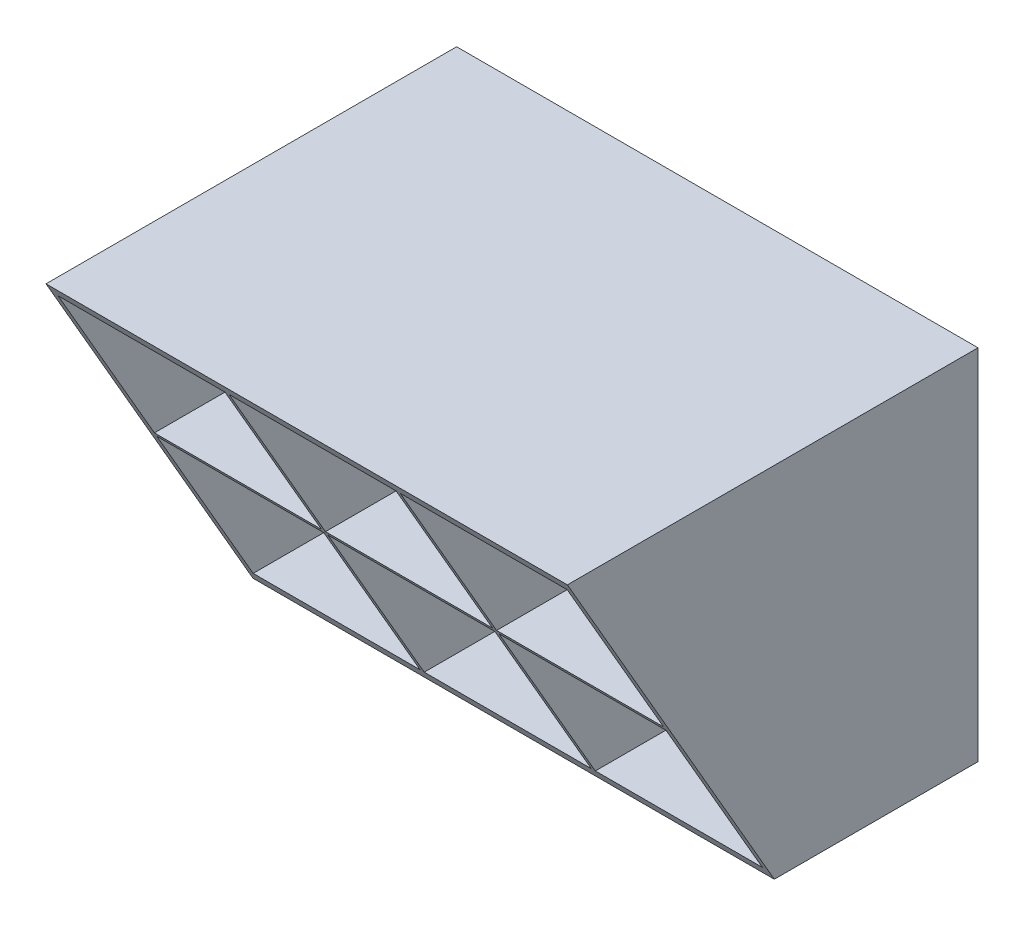
ISO-10303-21;
HEADER;
FILE_DESCRIPTION(('STEP AP214'),'2;1');
FILE_NAME('part.step','',(''),(''),'','','');
FILE_SCHEMA(('AUTOMOTIVE_DESIGN { 1 0 10303 214 1 1 1 1 }'));
ENDSEC;
DATA;
#1=APPLICATION_CONTEXT('core data for automotive mechanical design processes');
#2=APPLICATION_PROTOCOL_DEFINITION('international standard','automotive_design',2000,#1);
#3=PRODUCT_CONTEXT('',#1,'mechanical');
#4=PRODUCT('Part','Part','',(#3));
#5=PRODUCT_RELATED_PRODUCT_CATEGORY('part','',(#4));
#6=PRODUCT_DEFINITION_FORMATION('','',#4);
#7=PRODUCT_DEFINITION_CONTEXT('part definition',#1,'design');
#8=PRODUCT_DEFINITION('design','',#6,#7);
#9=PRODUCT_DEFINITION_SHAPE('','',#8);
#10=(LENGTH_UNIT() NAMED_UNIT(*) SI_UNIT(.MILLI.,.METRE.));
#11=(NAMED_UNIT(*) PLANE_ANGLE_UNIT() SI_UNIT($,.RADIAN.));
#12=(NAMED_UNIT(*) SI_UNIT($,.STERADIAN.) SOLID_ANGLE_UNIT());
#13=UNCERTAINTY_MEASURE_WITH_UNIT(LENGTH_MEASURE(1.E-05),#10,'distance_accuracy_value','');
#14=(GEOMETRIC_REPRESENTATION_CONTEXT(3) GLOBAL_UNCERTAINTY_ASSIGNED_CONTEXT((#13)) GLOBAL_UNIT_ASSIGNED_CONTEXT((#10,
#11,#12)) REPRESENTATION_CONTEXT('',''));
#15=CARTESIAN_POINT('',(0.,0.,0.));
#16=DIRECTION('',(0.,0.,1.));
#17=DIRECTION('',(1.,0.,0.));
#18=AXIS2_PLACEMENT_3D('',#15,#16,#17);
#19=CARTESIAN_POINT('',(-44.3982004158116,-9.53089722298802,25.0000000000002));
#20=DIRECTION('',(0.,-0.500000000000001,0.866025403784438));
#21=DIRECTION('',(0.,-0.866025403784438,-0.500000000000001));
#22=AXIS2_PLACEMENT_3D('',#19,#20,#21);
#23=PLANE('',#22);
#24=DIRECTION('',(0.,-0.866025403784438,-0.500000000000001));
#25=VECTOR('',#24,1.);
#26=CARTESIAN_POINT('',(-1.6482004158117,22.5316027770119,43.5112930058926));
#27=LINE('',#26,#25);
#28=CARTESIAN_POINT('',(-1.6482004158117,33.219102777012,49.6817240078568));
#29=VERTEX_POINT('',#28);
#30=CARTESIAN_POINT('',(-1.6482004158117,12.719102777012,37.8460434894694));
#31=VERTEX_POINT('',#30);
#32=EDGE_CURVE('E338',#29,#31,#27,.T.);
#33=ORIENTED_EDGE('',*,*,#32,.F.);
#34=DIRECTION('',(-1.,0.,0.));
#35=VECTOR('',#34,1.);
#36=CARTESIAN_POINT('',(-1.64820041581169,33.219102777012,49.6817240078568));
#37=LINE('',#36,#35);
#38=CARTESIAN_POINT('',(18.8517995841883,33.219102777012,49.6817240078568));
#39=VERTEX_POINT('',#38);
#40=EDGE_CURVE('E198',#39,#29,#37,.T.);
#41=ORIENTED_EDGE('',*,*,#40,.F.);
#42=DIRECTION('',(0.,0.866025403784438,0.500000000000001));
#43=VECTOR('',#42,1.);
#44=CARTESIAN_POINT('',(18.8517995841883,22.5316027770119,43.5112930058926));
#45=LINE('',#44,#43);
#46=CARTESIAN_POINT('',(18.8517995841883,12.719102777012,37.8460434894694));
#47=VERTEX_POINT('',#46);
#48=EDGE_CURVE('E203',#47,#39,#45,.T.);
#49=ORIENTED_EDGE('',*,*,#48,.F.);
#50=DIRECTION('',(1.,0.,0.));
#51=VECTOR('',#50,1.);
#52=CARTESIAN_POINT('',(-1.6482004158117,12.719102777012,37.8460434894694));
#53=LINE('',#52,#51);
#54=EDGE_CURVE('E340',#31,#47,#53,.T.);
#55=ORIENTED_EDGE('',*,*,#54,.F.);
#56=EDGE_LOOP('',(#33,#41,#49,#55));
#57=FACE_BOUND('',#56,.T.);
#58=DIRECTION('',(0.,-0.866025403784438,-0.500000000000001));
#59=VECTOR('',#58,1.);
#60=CARTESIAN_POINT('',(-22.6482004158117,22.5316027770119,43.5112930058926));
#61=LINE('',#60,#59);
#62=CARTESIAN_POINT('',(-22.6482004158117,33.219102777012,49.6817240078568));
#63=VERTEX_POINT('',#62);
#64=CARTESIAN_POINT('',(-22.6482004158117,12.719102777012,37.8460434894694));
#65=VERTEX_POINT('',#64);
#66=EDGE_CURVE('E345',#63,#65,#61,.T.);
#67=ORIENTED_EDGE('',*,*,#66,.F.);
#68=DIRECTION('',(-1.,0.,0.));
#69=VECTOR('',#68,1.);
#70=CARTESIAN_POINT('',(-22.6482004158117,33.219102777012,49.6817240078568));
#71=LINE('',#70,#69);
#72=CARTESIAN_POINT('',(-2.1482004158117,33.219102777012,49.6817240078568));
#73=VERTEX_POINT('',#72);
#74=EDGE_CURVE('E224',#73,#63,#71,.T.);
#75=ORIENTED_EDGE('',*,*,#74,.F.);
#76=DIRECTION('',(0.,0.866025403784438,0.500000000000001));
#77=VECTOR('',#76,1.);
#78=CARTESIAN_POINT('',(-2.1482004158117,22.5316027770119,43.5112930058926));
#79=LINE('',#78,#77);
#80=CARTESIAN_POINT('',(-2.1482004158117,12.719102777012,37.8460434894694));
#81=VERTEX_POINT('',#80);
#82=EDGE_CURVE('E229',#81,#73,#79,.T.);
#83=ORIENTED_EDGE('',*,*,#82,.F.);
#84=DIRECTION('',(1.,0.,0.));
#85=VECTOR('',#84,1.);
#86=CARTESIAN_POINT('',(-22.6482004158117,12.719102777012,37.8460434894694));
#87=LINE('',#86,#85);
#88=EDGE_CURVE('E347',#65,#81,#87,.T.);
#89=ORIENTED_EDGE('',*,*,#88,.F.);
#90=EDGE_LOOP('',(#67,#75,#83,#89));
#91=FACE_BOUND('',#90,.T.);
#92=DIRECTION('',(0.,-0.866025403784438,-0.500000000000001));
#93=VECTOR('',#92,1.);
#94=CARTESIAN_POINT('',(-1.64820041581162,6.78160277701196,34.418026266156));
#95=LINE('',#94,#93);
#96=CARTESIAN_POINT('',(-1.64820041581162,12.219102777012,37.5573683548746));
#97=VERTEX_POINT('',#96);
#98=CARTESIAN_POINT('',(-1.64820041581162,-8.28089722298802,25.7216878364872));
#99=VERTEX_POINT('',#98);
#100=EDGE_CURVE('E352',#97,#99,#95,.T.);
#101=ORIENTED_EDGE('',*,*,#100,.F.);
#102=DIRECTION('',(-1.,0.,0.));
#103=VECTOR('',#102,1.);
#104=CARTESIAN_POINT('',(-1.64820041581162,12.219102777012,37.5573683548746));
#105=LINE('',#104,#103);
#106=CARTESIAN_POINT('',(18.8517995841884,12.219102777012,37.5573683548746));
#107=VERTEX_POINT('',#106);
#108=EDGE_CURVE('E250',#107,#97,#105,.T.);
#109=ORIENTED_EDGE('',*,*,#108,.F.);
#110=DIRECTION('',(0.,0.866025403784438,0.500000000000001));
#111=VECTOR('',#110,1.);
#112=CARTESIAN_POINT('',(18.8517995841884,6.78160277701195,34.418026266156));
#113=LINE('',#112,#111);
#114=CARTESIAN_POINT('',(18.8517995841884,-8.28089722298802,25.7216878364872));
#115=VERTEX_POINT('',#114);
#116=EDGE_CURVE('E255',#115,#107,#113,.T.);
#117=ORIENTED_EDGE('',*,*,#116,.F.);
#118=DIRECTION('',(1.,0.,0.));
#119=VECTOR('',#118,1.);
#120=CARTESIAN_POINT('',(-1.64820041581162,-8.28089722298802,25.7216878364872));
#121=LINE('',#120,#119);
#122=EDGE_CURVE('E354',#99,#115,#121,.T.);
#123=ORIENTED_EDGE('',*,*,#122,.F.);
#124=EDGE_LOOP('',(#101,#109,#117,#123));
#125=FACE_BOUND('',#124,.T.);
#126=DIRECTION('',(0.,-0.866025403784438,-0.500000000000001));
#127=VECTOR('',#126,1.);
#128=CARTESIAN_POINT('',(-22.6482004158116,6.78160277701196,34.418026266156));
#129=LINE('',#128,#127);
#130=CARTESIAN_POINT('',(-22.6482004158116,12.219102777012,37.5573683548746));
#131=VERTEX_POINT('',#130);
#132=CARTESIAN_POINT('',(-22.6482004158116,-8.28089722298802,25.7216878364872));
#133=VERTEX_POINT('',#132);
#134=EDGE_CURVE('E359',#131,#133,#129,.T.);
#135=ORIENTED_EDGE('',*,*,#134,.F.);
#136=DIRECTION('',(-1.,0.,0.));
#137=VECTOR('',#136,1.);
#138=CARTESIAN_POINT('',(-22.6482004158116,12.219102777012,37.5573683548746));
#139=LINE('',#138,#137);
#140=CARTESIAN_POINT('',(-2.14820041581162,12.219102777012,37.5573683548746));
#141=VERTEX_POINT('',#140);
#142=EDGE_CURVE('E276',#141,#131,#139,.T.);
#143=ORIENTED_EDGE('',*,*,#142,.F.);
#144=DIRECTION('',(0.,0.866025403784438,0.500000000000001));
#145=VECTOR('',#144,1.);
#146=CARTESIAN_POINT('',(-2.14820041581162,6.78160277701195,34.418026266156));
#147=LINE('',#146,#145);
#148=CARTESIAN_POINT('',(-2.14820041581162,-8.28089722298802,25.7216878364872));
#149=VERTEX_POINT('',#148);
#150=EDGE_CURVE('E281',#149,#141,#147,.T.);
#151=ORIENTED_EDGE('',*,*,#150,.F.);
#152=DIRECTION('',(1.,0.,0.));
#153=VECTOR('',#152,1.);
#154=CARTESIAN_POINT('',(-22.6482004158116,-8.28089722298802,25.7216878364872));
#155=LINE('',#154,#153);
#156=EDGE_CURVE('E361',#133,#149,#155,.T.);
#157=ORIENTED_EDGE('',*,*,#156,.F.);
#158=EDGE_LOOP('',(#135,#143,#151,#157));
#159=FACE_BOUND('',#158,.T.);
#160=DIRECTION('',(0.,-0.866025403784438,-0.500000000000001));
#161=VECTOR('',#160,1.);
#162=CARTESIAN_POINT('',(-43.6482004158117,22.5316027770119,43.5112930058926));
#163=LINE('',#162,#161);
#164=CARTESIAN_POINT('',(-43.6482004158117,33.219102777012,49.6817240078568));
#165=VERTEX_POINT('',#164);
#166=CARTESIAN_POINT('',(-43.6482004158117,12.719102777012,37.8460434894694));
#167=VERTEX_POINT('',#166);
#168=EDGE_CURVE('E366',#165,#167,#163,.T.);
#169=ORIENTED_EDGE('',*,*,#168,.F.);
#170=DIRECTION('',(-1.,0.,0.));
#171=VECTOR('',#170,1.);
#172=CARTESIAN_POINT('',(-43.6482004158117,33.219102777012,49.6817240078568));
#173=LINE('',#172,#171);
#174=CARTESIAN_POINT('',(-23.1482004158117,33.219102777012,49.6817240078568));
#175=VERTEX_POINT('',#174);
#176=EDGE_CURVE('E302',#175,#165,#173,.T.);
#177=ORIENTED_EDGE('',*,*,#176,.F.);
#178=DIRECTION('',(0.,0.866025403784438,0.500000000000001));
#179=VECTOR('',#178,1.);
#180=CARTESIAN_POINT('',(-23.1482004158117,22.5316027770119,43.5112930058926));
#181=LINE('',#180,#179);
#182=CARTESIAN_POINT('',(-23.1482004158117,12.719102777012,37.8460434894694));
#183=VERTEX_POINT('',#182);
#184=EDGE_CURVE('E307',#183,#175,#181,.T.);
#185=ORIENTED_EDGE('',*,*,#184,.F.);
#186=DIRECTION('',(1.,0.,0.));
#187=VECTOR('',#186,1.);
#188=CARTESIAN_POINT('',(-43.6482004158117,12.719102777012,37.8460434894694));
#189=LINE('',#188,#187);
#190=EDGE_CURVE('E368',#167,#183,#189,.T.);
#191=ORIENTED_EDGE('',*,*,#190,.F.);
#192=EDGE_LOOP('',(#169,#177,#185,#191));
#193=FACE_BOUND('',#192,.T.);
#194=DIRECTION('',(1.,0.,0.));
#195=VECTOR('',#194,1.);
#196=CARTESIAN_POINT('',(-43.6482004158116,-8.28089722298802,25.7216878364872));
#197=LINE('',#196,#195);
#198=CARTESIAN_POINT('',(-43.6482004158116,-8.28089722298802,25.7216878364872));
#199=VERTEX_POINT('',#198);
#200=CARTESIAN_POINT('',(-23.1482004158116,-8.28089722298802,25.7216878364872));
#201=VERTEX_POINT('',#200);
#202=EDGE_CURVE('E373',#199,#201,#197,.T.);
#203=ORIENTED_EDGE('',*,*,#202,.F.);
#204=DIRECTION('',(0.,-0.866025403784438,-0.500000000000001));
#205=VECTOR('',#204,1.);
#206=CARTESIAN_POINT('',(-43.6482004158116,6.78160277701196,34.418026266156));
#207=LINE('',#206,#205);
#208=CARTESIAN_POINT('',(-43.6482004158116,12.219102777012,37.5573683548746));
#209=VERTEX_POINT('',#208);
#210=EDGE_CURVE('E328',#209,#199,#207,.T.);
#211=ORIENTED_EDGE('',*,*,#210,.F.);
#212=DIRECTION('',(-1.,0.,0.));
#213=VECTOR('',#212,1.);
#214=CARTESIAN_POINT('',(-43.6482004158116,12.219102777012,37.5573683548746));
#215=LINE('',#214,#213);
#216=CARTESIAN_POINT('',(-23.1482004158116,12.219102777012,37.5573683548746));
#217=VERTEX_POINT('',#216);
#218=EDGE_CURVE('E333',#217,#209,#215,.T.);
#219=ORIENTED_EDGE('',*,*,#218,.F.);
#220=DIRECTION('',(0.,0.866025403784438,0.500000000000001));
#221=VECTOR('',#220,1.);
#222=CARTESIAN_POINT('',(-23.1482004158116,6.78160277701195,34.418026266156));
#223=LINE('',#222,#221);
#224=EDGE_CURVE('E375',#201,#217,#223,.T.);
#225=ORIENTED_EDGE('',*,*,#224,.F.);
#226=EDGE_LOOP('',(#203,#211,#219,#225));
#227=FACE_BOUND('',#226,.T.);
#228=DIRECTION('',(1.,0.,0.));
#229=VECTOR('',#228,1.);
#230=CARTESIAN_POINT('',(-44.3982004158116,-9.53089722298802,25.0000000000002));
#231=LINE('',#230,#229);
#232=CARTESIAN_POINT('',(-44.3982004158116,-9.53089722298802,25.0000000000002));
#233=VERTEX_POINT('',#232);
#234=CARTESIAN_POINT('',(19.6017995841884,-9.53089722298802,25.0000000000002));
#235=VERTEX_POINT('',#234);
#236=EDGE_CURVE('E175',#233,#235,#231,.T.);
#237=ORIENTED_EDGE('',*,*,#236,.T.);
#238=DIRECTION('',(0.,0.866025403784438,0.500000000000001));
#239=VECTOR('',#238,1.);
#240=CARTESIAN_POINT('',(19.6017995841884,-9.53089722298803,25.0000000000002));
#241=LINE('',#240,#239);
#242=CARTESIAN_POINT('',(19.6017995841884,34.469102777012,50.4034118443438));
#243=VERTEX_POINT('',#242);
#244=EDGE_CURVE('E36',#235,#243,#241,.T.);
#245=ORIENTED_EDGE('',*,*,#244,.T.);
#246=DIRECTION('',(-1.,0.,0.));
#247=VECTOR('',#246,1.);
#248=CARTESIAN_POINT('',(-44.3982004158116,34.469102777012,50.4034118443438));
#249=LINE('',#248,#247);
#250=CARTESIAN_POINT('',(-44.3982004158116,34.469102777012,50.4034118443438));
#251=VERTEX_POINT('',#250);
#252=EDGE_CURVE('E169',#243,#251,#249,.T.);
#253=ORIENTED_EDGE('',*,*,#252,.T.);
#254=DIRECTION('',(0.,-0.866025403784438,-0.500000000000001));
#255=VECTOR('',#254,1.);
#256=CARTESIAN_POINT('',(-44.3982004158116,-9.53089722298802,25.0000000000002));
#257=LINE('',#256,#255);
#258=EDGE_CURVE('E151',#251,#233,#257,.T.);
#259=ORIENTED_EDGE('',*,*,#258,.T.);
#260=EDGE_LOOP('',(#237,#245,#253,#259));
#261=FACE_BOUND('',#260,.T.);
#262=ADVANCED_FACE('F33',(#57,#91,#125,#159,#193,#227,#261),#23,.T.);
#263=CARTESIAN_POINT('',(36.9866380266075,-28.7048863636364,2.00445150144498E-13));
#264=DIRECTION('',(0.,0.,1.));
#265=DIRECTION('',(1.,0.,0.));
#266=AXIS2_PLACEMENT_3D('',#263,#264,#265);
#267=PLANE('',#266);
#268=DIRECTION('',(-1.,0.,0.));
#269=VECTOR('',#268,1.);
#270=CARTESIAN_POINT('',(-1.6482004158117,33.219102777012,2.00445150144498E-13));
#271=LINE('',#270,#269);
#272=CARTESIAN_POINT('',(18.8517995841883,33.219102777012,2.00445150144498E-13));
#273=VERTEX_POINT('',#272);
#274=CARTESIAN_POINT('',(-1.6482004158117,33.219102777012,2.00445150144498E-13));
#275=VERTEX_POINT('',#274);
#276=EDGE_CURVE('E182',#273,#275,#271,.T.);
#277=ORIENTED_EDGE('',*,*,#276,.T.);
#278=DIRECTION('',(0.,-1.,0.));
#279=VECTOR('',#278,1.);
#280=CARTESIAN_POINT('',(-1.6482004158117,33.219102777012,2.00445150144498E-13));
#281=LINE('',#280,#279);
#282=CARTESIAN_POINT('',(-1.6482004158117,12.719102777012,2.00445150144498E-13));
#283=VERTEX_POINT('',#282);
#284=EDGE_CURVE('E189',#275,#283,#281,.T.);
#285=ORIENTED_EDGE('',*,*,#284,.T.);
#286=DIRECTION('',(1.,0.,0.));
#287=VECTOR('',#286,1.);
#288=CARTESIAN_POINT('',(-1.6482004158117,12.719102777012,2.00445150144498E-13));
#289=LINE('',#288,#287);
#290=CARTESIAN_POINT('',(18.8517995841883,12.719102777012,2.00445150144498E-13));
#291=VERTEX_POINT('',#290);
#292=EDGE_CURVE('E192',#283,#291,#289,.T.);
#293=ORIENTED_EDGE('',*,*,#292,.T.);
#294=DIRECTION('',(0.,1.,0.));
#295=VECTOR('',#294,1.);
#296=CARTESIAN_POINT('',(18.8517995841883,33.219102777012,2.00445150144498E-13));
#297=LINE('',#296,#295);
#298=EDGE_CURVE('E195',#291,#273,#297,.T.);
#299=ORIENTED_EDGE('',*,*,#298,.T.);
#300=EDGE_LOOP('',(#277,#285,#293,#299));
#301=FACE_BOUND('',#300,.T.);
#302=DIRECTION('',(-1.,0.,0.));
#303=VECTOR('',#302,1.);
#304=CARTESIAN_POINT('',(-1.64820041581162,12.219102777012,2.00445150144498E-13));
#305=LINE('',#304,#303);
#306=CARTESIAN_POINT('',(18.8517995841884,12.219102777012,2.00445150144498E-13));
#307=VERTEX_POINT('',#306);
#308=CARTESIAN_POINT('',(-1.64820041581162,12.219102777012,2.00445150144498E-13));
#309=VERTEX_POINT('',#308);
#310=EDGE_CURVE('E238',#307,#309,#305,.T.);
#311=ORIENTED_EDGE('',*,*,#310,.T.);
#312=DIRECTION('',(0.,-1.,0.));
#313=VECTOR('',#312,1.);
#314=CARTESIAN_POINT('',(-1.64820041581162,12.219102777012,2.00445150144498E-13));
#315=LINE('',#314,#313);
#316=CARTESIAN_POINT('',(-1.64820041581162,-8.28089722298802,2.00445150144498E-13));
#317=VERTEX_POINT('',#316);
#318=EDGE_CURVE('E241',#309,#317,#315,.T.);
#319=ORIENTED_EDGE('',*,*,#318,.T.);
#320=DIRECTION('',(1.,0.,0.));
#321=VECTOR('',#320,1.);
#322=CARTESIAN_POINT('',(-1.64820041581162,-8.28089722298802,2.00445150144498E-13));
#323=LINE('',#322,#321);
#324=CARTESIAN_POINT('',(18.8517995841884,-8.28089722298802,2.00445150144498E-13));
#325=VERTEX_POINT('',#324);
#326=EDGE_CURVE('E244',#317,#325,#323,.T.);
#327=ORIENTED_EDGE('',*,*,#326,.T.);
#328=DIRECTION('',(0.,1.,0.));
#329=VECTOR('',#328,1.);
#330=CARTESIAN_POINT('',(18.8517995841884,12.219102777012,2.00445150144498E-13));
#331=LINE('',#330,#329);
#332=EDGE_CURVE('E247',#325,#307,#331,.T.);
#333=ORIENTED_EDGE('',*,*,#332,.T.);
#334=EDGE_LOOP('',(#311,#319,#327,#333));
#335=FACE_BOUND('',#334,.T.);
#336=DIRECTION('',(-1.,0.,0.));
#337=VECTOR('',#336,1.);
#338=CARTESIAN_POINT('',(-43.6482004158117,33.219102777012,2.00445150144498E-13));
#339=LINE('',#338,#337);
#340=CARTESIAN_POINT('',(-23.1482004158117,33.219102777012,2.00445150144498E-13));
#341=VERTEX_POINT('',#340);
#342=CARTESIAN_POINT('',(-43.6482004158117,33.219102777012,2.00445150144498E-13));
#343=VERTEX_POINT('',#342);
#344=EDGE_CURVE('E290',#341,#343,#339,.T.);
#345=ORIENTED_EDGE('',*,*,#344,.T.);
#346=DIRECTION('',(0.,-1.,0.));
#347=VECTOR('',#346,1.);
#348=CARTESIAN_POINT('',(-43.6482004158117,33.219102777012,2.00445150144498E-13));
#349=LINE('',#348,#347);
#350=CARTESIAN_POINT('',(-43.6482004158117,12.719102777012,2.00445150144498E-13));
#351=VERTEX_POINT('',#350);
#352=EDGE_CURVE('E293',#343,#351,#349,.T.);
#353=ORIENTED_EDGE('',*,*,#352,.T.);
#354=DIRECTION('',(1.,0.,0.));
#355=VECTOR('',#354,1.);
#356=CARTESIAN_POINT('',(-43.6482004158117,12.719102777012,2.00445150144498E-13));
#357=LINE('',#356,#355);
#358=CARTESIAN_POINT('',(-23.1482004158117,12.719102777012,2.00445150144498E-13));
#359=VERTEX_POINT('',#358);
#360=EDGE_CURVE('E296',#351,#359,#357,.T.);
#361=ORIENTED_EDGE('',*,*,#360,.T.);
#362=DIRECTION('',(0.,1.,0.));
#363=VECTOR('',#362,1.);
#364=CARTESIAN_POINT('',(-23.1482004158117,33.219102777012,2.00445150144498E-13));
#365=LINE('',#364,#363);
#366=EDGE_CURVE('E299',#359,#341,#365,.T.);
#367=ORIENTED_EDGE('',*,*,#366,.T.);
#368=EDGE_LOOP('',(#345,#353,#361,#367));
#369=FACE_BOUND('',#368,.T.);
#370=DIRECTION('',(0.,-1.,0.));
#371=VECTOR('',#370,1.);
#372=CARTESIAN_POINT('',(-43.6482004158116,12.219102777012,2.00445150144498E-13));
#373=LINE('',#372,#371);
#374=CARTESIAN_POINT('',(-43.6482004158116,12.219102777012,2.00445150144498E-13));
#375=VERTEX_POINT('',#374);
#376=CARTESIAN_POINT('',(-43.6482004158116,-8.28089722298802,2.00445150144498E-13));
#377=VERTEX_POINT('',#376);
#378=EDGE_CURVE('E316',#375,#377,#373,.T.);
#379=ORIENTED_EDGE('',*,*,#378,.T.);
#380=DIRECTION('',(1.,0.,0.));
#381=VECTOR('',#380,1.);
#382=CARTESIAN_POINT('',(-43.6482004158116,-8.28089722298802,2.00445150144498E-13));
#383=LINE('',#382,#381);
#384=CARTESIAN_POINT('',(-23.1482004158116,-8.28089722298802,2.00445150144498E-13));
#385=VERTEX_POINT('',#384);
#386=EDGE_CURVE('E319',#377,#385,#383,.T.);
#387=ORIENTED_EDGE('',*,*,#386,.T.);
#388=DIRECTION('',(0.,1.,0.));
#389=VECTOR('',#388,1.);
#390=CARTESIAN_POINT('',(-23.1482004158116,12.219102777012,2.00445150144498E-13));
#391=LINE('',#390,#389);
#392=CARTESIAN_POINT('',(-23.1482004158116,12.219102777012,2.00445150144498E-13));
#393=VERTEX_POINT('',#392);
#394=EDGE_CURVE('E322',#385,#393,#391,.T.);
#395=ORIENTED_EDGE('',*,*,#394,.T.);
#396=DIRECTION('',(-1.,0.,0.));
#397=VECTOR('',#396,1.);
#398=CARTESIAN_POINT('',(-43.6482004158116,12.219102777012,2.00445150144498E-13));
#399=LINE('',#398,#397);
#400=EDGE_CURVE('E325',#393,#375,#399,.T.);
#401=ORIENTED_EDGE('',*,*,#400,.T.);
#402=EDGE_LOOP('',(#379,#387,#395,#401));
#403=FACE_BOUND('',#402,.T.);
#404=DIRECTION('',(-1.,0.,0.));
#405=VECTOR('',#404,1.);
#406=CARTESIAN_POINT('',(-22.6482004158116,12.219102777012,2.00445150144498E-13));
#407=LINE('',#406,#405);
#408=CARTESIAN_POINT('',(-2.14820041581162,12.219102777012,2.00445150144498E-13));
#409=VERTEX_POINT('',#408);
#410=CARTESIAN_POINT('',(-22.6482004158116,12.219102777012,2.00445150144498E-13));
#411=VERTEX_POINT('',#410);
#412=EDGE_CURVE('E264',#409,#411,#407,.T.);
#413=ORIENTED_EDGE('',*,*,#412,.T.);
#414=DIRECTION('',(0.,-1.,0.));
#415=VECTOR('',#414,1.);
#416=CARTESIAN_POINT('',(-22.6482004158116,12.219102777012,2.00445150144498E-13));
#417=LINE('',#416,#415);
#418=CARTESIAN_POINT('',(-22.6482004158116,-8.28089722298802,2.00445150144498E-13));
#419=VERTEX_POINT('',#418);
#420=EDGE_CURVE('E267',#411,#419,#417,.T.);
#421=ORIENTED_EDGE('',*,*,#420,.T.);
#422=DIRECTION('',(1.,0.,0.));
#423=VECTOR('',#422,1.);
#424=CARTESIAN_POINT('',(-22.6482004158116,-8.28089722298802,2.00445150144498E-13));
#425=LINE('',#424,#423);
#426=CARTESIAN_POINT('',(-2.14820041581162,-8.28089722298802,2.00445150144498E-13));
#427=VERTEX_POINT('',#426);
#428=EDGE_CURVE('E270',#419,#427,#425,.T.);
#429=ORIENTED_EDGE('',*,*,#428,.T.);
#430=DIRECTION('',(0.,1.,0.));
#431=VECTOR('',#430,1.);
#432=CARTESIAN_POINT('',(-2.14820041581162,12.219102777012,2.00445150144498E-13));
#433=LINE('',#432,#431);
#434=EDGE_CURVE('E273',#427,#409,#433,.T.);
#435=ORIENTED_EDGE('',*,*,#434,.T.);
#436=EDGE_LOOP('',(#413,#421,#429,#435));
#437=FACE_BOUND('',#436,.T.);
#438=DIRECTION('',(-1.,0.,0.));
#439=VECTOR('',#438,1.);
#440=CARTESIAN_POINT('',(-22.6482004158117,33.219102777012,2.00445150144498E-13));
#441=LINE('',#440,#439);
#442=CARTESIAN_POINT('',(-2.1482004158117,33.219102777012,2.00445150144498E-13));
#443=VERTEX_POINT('',#442);
#444=CARTESIAN_POINT('',(-22.6482004158117,33.219102777012,2.00445150144498E-13));
#445=VERTEX_POINT('',#444);
#446=EDGE_CURVE('E212',#443,#445,#441,.T.);
#447=ORIENTED_EDGE('',*,*,#446,.T.);
#448=DIRECTION('',(0.,-1.,0.));
#449=VECTOR('',#448,1.);
#450=CARTESIAN_POINT('',(-22.6482004158117,33.219102777012,2.00445150144498E-13));
#451=LINE('',#450,#449);
#452=CARTESIAN_POINT('',(-22.6482004158117,12.719102777012,2.00445150144498E-13));
#453=VERTEX_POINT('',#452);
#454=EDGE_CURVE('E215',#445,#453,#451,.T.);
#455=ORIENTED_EDGE('',*,*,#454,.T.);
#456=DIRECTION('',(1.,0.,0.));
#457=VECTOR('',#456,1.);
#458=CARTESIAN_POINT('',(-22.6482004158117,12.719102777012,2.00445150144498E-13));
#459=LINE('',#458,#457);
#460=CARTESIAN_POINT('',(-2.1482004158117,12.719102777012,2.00445150144498E-13));
#461=VERTEX_POINT('',#460);
#462=EDGE_CURVE('E218',#453,#461,#459,.T.);
#463=ORIENTED_EDGE('',*,*,#462,.T.);
#464=DIRECTION('',(0.,1.,0.));
#465=VECTOR('',#464,1.);
#466=CARTESIAN_POINT('',(-2.1482004158117,33.219102777012,2.00445150144498E-13));
#467=LINE('',#466,#465);
#468=EDGE_CURVE('E221',#461,#443,#467,.T.);
#469=ORIENTED_EDGE('',*,*,#468,.T.);
#470=EDGE_LOOP('',(#447,#455,#463,#469));
#471=FACE_BOUND('',#470,.T.);
#472=DIRECTION('',(-1.,0.,0.));
#473=VECTOR('',#472,1.);
#474=CARTESIAN_POINT('',(-44.3982004158116,34.469102777012,2.0122792321331E-13));
#475=LINE('',#474,#473);
#476=CARTESIAN_POINT('',(19.6017995841884,34.469102777012,2.0122792321331E-13));
#477=VERTEX_POINT('',#476);
#478=CARTESIAN_POINT('',(-44.3982004158116,34.469102777012,2.0122792321331E-13));
#479=VERTEX_POINT('',#478);
#480=EDGE_CURVE('E180',#477,#479,#475,.T.);
#481=ORIENTED_EDGE('',*,*,#480,.F.);
#482=DIRECTION('',(0.,1.,0.));
#483=VECTOR('',#482,1.);
#484=CARTESIAN_POINT('',(19.6017995841884,34.469102777012,2.0122792321331E-13));
#485=LINE('',#484,#483);
#486=CARTESIAN_POINT('',(19.6017995841884,-9.53089722298802,2.0122792321331E-13));
#487=VERTEX_POINT('',#486);
#488=EDGE_CURVE('E161',#487,#477,#485,.T.);
#489=ORIENTED_EDGE('',*,*,#488,.F.);
#490=DIRECTION('',(1.,0.,0.));
#491=VECTOR('',#490,1.);
#492=CARTESIAN_POINT('',(-44.3982004158116,-9.53089722298802,2.0122792321331E-13));
#493=LINE('',#492,#491);
#494=CARTESIAN_POINT('',(-44.3982004158116,-9.53089722298802,2.00445150144498E-13));
#495=VERTEX_POINT('',#494);
#496=EDGE_CURVE('E755',#495,#487,#493,.T.);
#497=ORIENTED_EDGE('',*,*,#496,.F.);
#498=DIRECTION('',(0.,-1.,0.));
#499=VECTOR('',#498,1.);
#500=CARTESIAN_POINT('',(-44.3982004158116,34.469102777012,2.0122792321331E-13));
#501=LINE('',#500,#499);
#502=EDGE_CURVE('E172',#479,#495,#501,.T.);
#503=ORIENTED_EDGE('',*,*,#502,.F.);
#504=EDGE_LOOP('',(#481,#489,#497,#503));
#505=FACE_BOUND('',#504,.T.);
#506=ADVANCED_FACE('F423',(#301,#335,#369,#403,#437,#471,#505),#267,.F.);
#507=CARTESIAN_POINT('',(-43.6482004158116,12.219102777012,25.0000000000002));
#508=DIRECTION('',(1.,0.,0.));
#509=DIRECTION('',(0.,0.,-1.));
#510=AXIS2_PLACEMENT_3D('',#507,#508,#509);
#511=PLANE('',#510);
#512=ORIENTED_EDGE('',*,*,#378,.F.);
#513=DIRECTION('',(0.,0.,-1.));
#514=VECTOR('',#513,1.);
#515=CARTESIAN_POINT('',(-43.6482004158116,12.219102777012,25.0000000000002));
#516=LINE('',#515,#514);
#517=EDGE_CURVE('E329',#209,#375,#516,.T.);
#518=ORIENTED_EDGE('',*,*,#517,.F.);
#519=ORIENTED_EDGE('',*,*,#210,.T.);
#520=DIRECTION('',(0.,0.,-1.));
#521=VECTOR('',#520,1.);
#522=CARTESIAN_POINT('',(-43.6482004158116,-8.28089722298802,25.0000000000002));
#523=LINE('',#522,#521);
#524=EDGE_CURVE('E11',#199,#377,#523,.T.);
#525=ORIENTED_EDGE('',*,*,#524,.T.);
#526=EDGE_LOOP('',(#512,#518,#519,#525));
#527=FACE_BOUND('',#526,.T.);
#528=ADVANCED_FACE('F384',(#527),#511,.T.);
#529=CARTESIAN_POINT('',(-43.6482004158116,-8.28089722298802,25.0000000000002));
#530=DIRECTION('',(0.,1.,0.));
#531=DIRECTION('',(0.,0.,1.));
#532=AXIS2_PLACEMENT_3D('',#529,#530,#531);
#533=PLANE('',#532);
#534=ORIENTED_EDGE('',*,*,#386,.F.);
#535=ORIENTED_EDGE('',*,*,#524,.F.);
#536=ORIENTED_EDGE('',*,*,#202,.T.);
#537=DIRECTION('',(0.,0.,-1.));
#538=VECTOR('',#537,1.);
#539=CARTESIAN_POINT('',(-23.1482004158116,-8.28089722298802,25.0000000000002));
#540=LINE('',#539,#538);
#541=EDGE_CURVE('E42',#201,#385,#540,.T.);
#542=ORIENTED_EDGE('',*,*,#541,.T.);
#543=EDGE_LOOP('',(#534,#535,#536,#542));
#544=FACE_BOUND('',#543,.T.);
#545=ADVANCED_FACE('F390',(#544),#533,.T.);
#546=CARTESIAN_POINT('',(-23.1482004158116,12.219102777012,25.0000000000002));
#547=DIRECTION('',(-1.,0.,0.));
#548=DIRECTION('',(0.,0.,1.));
#549=AXIS2_PLACEMENT_3D('',#546,#547,#548);
#550=PLANE('',#549);
#551=ORIENTED_EDGE('',*,*,#394,.F.);
#552=ORIENTED_EDGE('',*,*,#541,.F.);
#553=ORIENTED_EDGE('',*,*,#224,.T.);
#554=DIRECTION('',(0.,0.,-1.));
#555=VECTOR('',#554,1.);
#556=CARTESIAN_POINT('',(-23.1482004158116,12.219102777012,25.0000000000002));
#557=LINE('',#556,#555);
#558=EDGE_CURVE('E332',#217,#393,#557,.T.);
#559=ORIENTED_EDGE('',*,*,#558,.T.);
#560=EDGE_LOOP('',(#551,#552,#553,#559));
#561=FACE_BOUND('',#560,.T.);
#562=ADVANCED_FACE('F395',(#561),#550,.T.);
#563=CARTESIAN_POINT('',(-43.6482004158116,12.219102777012,25.0000000000002));
#564=DIRECTION('',(0.,-1.,0.));
#565=DIRECTION('',(1.,0.,0.));
#566=AXIS2_PLACEMENT_3D('',#563,#564,#565);
#567=PLANE('',#566);
#568=ORIENTED_EDGE('',*,*,#400,.F.);
#569=ORIENTED_EDGE('',*,*,#558,.F.);
#570=ORIENTED_EDGE('',*,*,#218,.T.);
#571=ORIENTED_EDGE('',*,*,#517,.T.);
#572=EDGE_LOOP('',(#568,#569,#570,#571));
#573=FACE_BOUND('',#572,.T.);
#574=ADVANCED_FACE('F536',(#573),#567,.T.);
#575=CARTESIAN_POINT('',(-43.6482004158117,33.219102777012,25.0000000000002));
#576=DIRECTION('',(0.,-1.,0.));
#577=DIRECTION('',(1.,0.,0.));
#578=AXIS2_PLACEMENT_3D('',#575,#576,#577);
#579=PLANE('',#578);
#580=ORIENTED_EDGE('',*,*,#344,.F.);
#581=DIRECTION('',(0.,0.,-1.));
#582=VECTOR('',#581,1.);
#583=CARTESIAN_POINT('',(-23.1482004158117,33.219102777012,25.0000000000002));
#584=LINE('',#583,#582);
#585=EDGE_CURVE('E303',#175,#341,#584,.T.);
#586=ORIENTED_EDGE('',*,*,#585,.F.);
#587=ORIENTED_EDGE('',*,*,#176,.T.);
#588=DIRECTION('',(0.,0.,-1.));
#589=VECTOR('',#588,1.);
#590=CARTESIAN_POINT('',(-43.6482004158117,33.219102777012,25.0000000000002));
#591=LINE('',#590,#589);
#592=EDGE_CURVE('E313',#165,#343,#591,.T.);
#593=ORIENTED_EDGE('',*,*,#592,.T.);
#594=EDGE_LOOP('',(#580,#586,#587,#593));
#595=FACE_BOUND('',#594,.T.);
#596=ADVANCED_FACE('F474',(#595),#579,.T.);
#597=CARTESIAN_POINT('',(-43.6482004158117,33.219102777012,25.0000000000002));
#598=DIRECTION('',(1.,0.,0.));
#599=DIRECTION('',(0.,0.,-1.));
#600=AXIS2_PLACEMENT_3D('',#597,#598,#599);
#601=PLANE('',#600);
#602=ORIENTED_EDGE('',*,*,#352,.F.);
#603=ORIENTED_EDGE('',*,*,#592,.F.);
#604=ORIENTED_EDGE('',*,*,#168,.T.);
#605=DIRECTION('',(0.,0.,-1.));
#606=VECTOR('',#605,1.);
#607=CARTESIAN_POINT('',(-43.6482004158117,12.719102777012,25.0000000000002));
#608=LINE('',#607,#606);
#609=EDGE_CURVE('E310',#167,#351,#608,.T.);
#610=ORIENTED_EDGE('',*,*,#609,.T.);
#611=EDGE_LOOP('',(#602,#603,#604,#610));
#612=FACE_BOUND('',#611,.T.);
#613=ADVANCED_FACE('F471',(#612),#601,.T.);
#614=CARTESIAN_POINT('',(-43.6482004158117,12.719102777012,25.0000000000002));
#615=DIRECTION('',(0.,1.,0.));
#616=DIRECTION('',(0.,0.,1.));
#617=AXIS2_PLACEMENT_3D('',#614,#615,#616);
#618=PLANE('',#617);
#619=ORIENTED_EDGE('',*,*,#360,.F.);
#620=ORIENTED_EDGE('',*,*,#609,.F.);
#621=ORIENTED_EDGE('',*,*,#190,.T.);
#622=DIRECTION('',(0.,0.,-1.));
#623=VECTOR('',#622,1.);
#624=CARTESIAN_POINT('',(-23.1482004158117,12.719102777012,25.0000000000002));
#625=LINE('',#624,#623);
#626=EDGE_CURVE('E306',#183,#359,#625,.T.);
#627=ORIENTED_EDGE('',*,*,#626,.T.);
#628=EDGE_LOOP('',(#619,#620,#621,#627));
#629=FACE_BOUND('',#628,.T.);
#630=ADVANCED_FACE('F460',(#629),#618,.T.);
#631=CARTESIAN_POINT('',(-23.1482004158117,33.219102777012,25.0000000000002));
#632=DIRECTION('',(-1.,0.,0.));
#633=DIRECTION('',(0.,0.,1.));
#634=AXIS2_PLACEMENT_3D('',#631,#632,#633);
#635=PLANE('',#634);
#636=ORIENTED_EDGE('',*,*,#366,.F.);
#637=ORIENTED_EDGE('',*,*,#626,.F.);
#638=ORIENTED_EDGE('',*,*,#184,.T.);
#639=ORIENTED_EDGE('',*,*,#585,.T.);
#640=EDGE_LOOP('',(#636,#637,#638,#639));
#641=FACE_BOUND('',#640,.T.);
#642=ADVANCED_FACE('F465',(#641),#635,.T.);
#643=CARTESIAN_POINT('',(-22.6482004158116,12.219102777012,25.0000000000002));
#644=DIRECTION('',(0.,-1.,0.));
#645=DIRECTION('',(1.,0.,0.));
#646=AXIS2_PLACEMENT_3D('',#643,#644,#645);
#647=PLANE('',#646);
#648=ORIENTED_EDGE('',*,*,#412,.F.);
#649=DIRECTION('',(0.,0.,-1.));
#650=VECTOR('',#649,1.);
#651=CARTESIAN_POINT('',(-2.14820041581162,12.219102777012,25.0000000000002));
#652=LINE('',#651,#650);
#653=EDGE_CURVE('E277',#141,#409,#652,.T.);
#654=ORIENTED_EDGE('',*,*,#653,.F.);
#655=ORIENTED_EDGE('',*,*,#142,.T.);
#656=DIRECTION('',(0.,0.,-1.));
#657=VECTOR('',#656,1.);
#658=CARTESIAN_POINT('',(-22.6482004158116,12.219102777012,25.0000000000002));
#659=LINE('',#658,#657);
#660=EDGE_CURVE('E287',#131,#411,#659,.T.);
#661=ORIENTED_EDGE('',*,*,#660,.T.);
#662=EDGE_LOOP('',(#648,#654,#655,#661));
#663=FACE_BOUND('',#662,.T.);
#664=ADVANCED_FACE('F507',(#663),#647,.T.);
#665=CARTESIAN_POINT('',(-22.6482004158116,12.219102777012,25.0000000000002));
#666=DIRECTION('',(1.,0.,0.));
#667=DIRECTION('',(0.,0.,-1.));
#668=AXIS2_PLACEMENT_3D('',#665,#666,#667);
#669=PLANE('',#668);
#670=ORIENTED_EDGE('',*,*,#420,.F.);
#671=ORIENTED_EDGE('',*,*,#660,.F.);
#672=ORIENTED_EDGE('',*,*,#134,.T.);
#673=DIRECTION('',(0.,0.,-1.));
#674=VECTOR('',#673,1.);
#675=CARTESIAN_POINT('',(-22.6482004158116,-8.28089722298802,25.0000000000002));
#676=LINE('',#675,#674);
#677=EDGE_CURVE('E284',#133,#419,#676,.T.);
#678=ORIENTED_EDGE('',*,*,#677,.T.);
#679=EDGE_LOOP('',(#670,#671,#672,#678));
#680=FACE_BOUND('',#679,.T.);
#681=ADVANCED_FACE('F499',(#680),#669,.T.);
#682=CARTESIAN_POINT('',(-22.6482004158116,-8.28089722298802,25.0000000000002));
#683=DIRECTION('',(0.,1.,0.));
#684=DIRECTION('',(0.,0.,1.));
#685=AXIS2_PLACEMENT_3D('',#682,#683,#684);
#686=PLANE('',#685);
#687=ORIENTED_EDGE('',*,*,#428,.F.);
#688=ORIENTED_EDGE('',*,*,#677,.F.);
#689=ORIENTED_EDGE('',*,*,#156,.T.);
#690=DIRECTION('',(0.,0.,-1.));
#691=VECTOR('',#690,1.);
#692=CARTESIAN_POINT('',(-2.14820041581162,-8.28089722298802,25.0000000000002));
#693=LINE('',#692,#691);
#694=EDGE_CURVE('E280',#149,#427,#693,.T.);
#695=ORIENTED_EDGE('',*,*,#694,.T.);
#696=EDGE_LOOP('',(#687,#688,#689,#695));
#697=FACE_BOUND('',#696,.T.);
#698=ADVANCED_FACE('F502',(#697),#686,.T.);
#699=CARTESIAN_POINT('',(-2.14820041581162,12.219102777012,25.0000000000002));
#700=DIRECTION('',(-1.,0.,0.));
#701=DIRECTION('',(0.,0.,1.));
#702=AXIS2_PLACEMENT_3D('',#699,#700,#701);
#703=PLANE('',#702);
#704=ORIENTED_EDGE('',*,*,#434,.F.);
#705=ORIENTED_EDGE('',*,*,#694,.F.);
#706=ORIENTED_EDGE('',*,*,#150,.T.);
#707=ORIENTED_EDGE('',*,*,#653,.T.);
#708=EDGE_LOOP('',(#704,#705,#706,#707));
#709=FACE_BOUND('',#708,.T.);
#710=ADVANCED_FACE('F510',(#709),#703,.T.);
#711=CARTESIAN_POINT('',(-1.64820041581162,12.219102777012,25.0000000000002));
#712=DIRECTION('',(0.,-1.,0.));
#713=DIRECTION('',(1.,0.,0.));
#714=AXIS2_PLACEMENT_3D('',#711,#712,#713);
#715=PLANE('',#714);
#716=ORIENTED_EDGE('',*,*,#310,.F.);
#717=DIRECTION('',(0.,0.,-1.));
#718=VECTOR('',#717,1.);
#719=CARTESIAN_POINT('',(18.8517995841884,12.219102777012,25.0000000000002));
#720=LINE('',#719,#718);
#721=EDGE_CURVE('E251',#107,#307,#720,.T.);
#722=ORIENTED_EDGE('',*,*,#721,.F.);
#723=ORIENTED_EDGE('',*,*,#108,.T.);
#724=DIRECTION('',(0.,0.,-1.));
#725=VECTOR('',#724,1.);
#726=CARTESIAN_POINT('',(-1.64820041581162,12.219102777012,25.0000000000002));
#727=LINE('',#726,#725);
#728=EDGE_CURVE('E261',#97,#309,#727,.T.);
#729=ORIENTED_EDGE('',*,*,#728,.T.);
#730=EDGE_LOOP('',(#716,#722,#723,#729));
#731=FACE_BOUND('',#730,.T.);
#732=ADVANCED_FACE('F512',(#731),#715,.T.);
#733=CARTESIAN_POINT('',(-1.64820041581162,12.219102777012,25.0000000000002));
#734=DIRECTION('',(1.,0.,0.));
#735=DIRECTION('',(0.,0.,-1.));
#736=AXIS2_PLACEMENT_3D('',#733,#734,#735);
#737=PLANE('',#736);
#738=ORIENTED_EDGE('',*,*,#318,.F.);
#739=ORIENTED_EDGE('',*,*,#728,.F.);
#740=ORIENTED_EDGE('',*,*,#100,.T.);
#741=DIRECTION('',(0.,0.,-1.));
#742=VECTOR('',#741,1.);
#743=CARTESIAN_POINT('',(-1.64820041581162,-8.28089722298802,25.0000000000002));
#744=LINE('',#743,#742);
#745=EDGE_CURVE('E258',#99,#317,#744,.T.);
#746=ORIENTED_EDGE('',*,*,#745,.T.);
#747=EDGE_LOOP('',(#738,#739,#740,#746));
#748=FACE_BOUND('',#747,.T.);
#749=ADVANCED_FACE('F518',(#748),#737,.T.);
#750=CARTESIAN_POINT('',(-1.64820041581162,-8.28089722298802,25.0000000000002));
#751=DIRECTION('',(0.,1.,0.));
#752=DIRECTION('',(0.,0.,1.));
#753=AXIS2_PLACEMENT_3D('',#750,#751,#752);
#754=PLANE('',#753);
#755=ORIENTED_EDGE('',*,*,#326,.F.);
#756=ORIENTED_EDGE('',*,*,#745,.F.);
#757=ORIENTED_EDGE('',*,*,#122,.T.);
#758=DIRECTION('',(0.,0.,-1.));
#759=VECTOR('',#758,1.);
#760=CARTESIAN_POINT('',(18.8517995841884,-8.28089722298802,25.0000000000002));
#761=LINE('',#760,#759);
#762=EDGE_CURVE('E254',#115,#325,#761,.T.);
#763=ORIENTED_EDGE('',*,*,#762,.T.);
#764=EDGE_LOOP('',(#755,#756,#757,#763));
#765=FACE_BOUND('',#764,.T.);
#766=ADVANCED_FACE('F608',(#765),#754,.T.);
#767=CARTESIAN_POINT('',(18.8517995841884,12.219102777012,25.0000000000002));
#768=DIRECTION('',(-1.,0.,0.));
#769=DIRECTION('',(0.,0.,1.));
#770=AXIS2_PLACEMENT_3D('',#767,#768,#769);
#771=PLANE('',#770);
#772=ORIENTED_EDGE('',*,*,#332,.F.);
#773=ORIENTED_EDGE('',*,*,#762,.F.);
#774=ORIENTED_EDGE('',*,*,#116,.T.);
#775=ORIENTED_EDGE('',*,*,#721,.T.);
#776=EDGE_LOOP('',(#772,#773,#774,#775));
#777=FACE_BOUND('',#776,.T.);
#778=ADVANCED_FACE('F617',(#777),#771,.T.);
#779=CARTESIAN_POINT('',(-22.6482004158117,33.219102777012,25.0000000000002));
#780=DIRECTION('',(0.,-1.,0.));
#781=DIRECTION('',(1.,0.,0.));
#782=AXIS2_PLACEMENT_3D('',#779,#780,#781);
#783=PLANE('',#782);
#784=ORIENTED_EDGE('',*,*,#446,.F.);
#785=DIRECTION('',(0.,0.,-1.));
#786=VECTOR('',#785,1.);
#787=CARTESIAN_POINT('',(-2.1482004158117,33.219102777012,25.0000000000002));
#788=LINE('',#787,#786);
#789=EDGE_CURVE('E225',#73,#443,#788,.T.);
#790=ORIENTED_EDGE('',*,*,#789,.F.);
#791=ORIENTED_EDGE('',*,*,#74,.T.);
#792=DIRECTION('',(0.,0.,-1.));
#793=VECTOR('',#792,1.);
#794=CARTESIAN_POINT('',(-22.6482004158117,33.219102777012,25.0000000000002));
#795=LINE('',#794,#793);
#796=EDGE_CURVE('E235',#63,#445,#795,.T.);
#797=ORIENTED_EDGE('',*,*,#796,.T.);
#798=EDGE_LOOP('',(#784,#790,#791,#797));
#799=FACE_BOUND('',#798,.T.);
#800=ADVANCED_FACE('F627',(#799),#783,.T.);
#801=CARTESIAN_POINT('',(-22.6482004158117,33.219102777012,25.0000000000002));
#802=DIRECTION('',(1.,0.,0.));
#803=DIRECTION('',(0.,0.,-1.));
#804=AXIS2_PLACEMENT_3D('',#801,#802,#803);
#805=PLANE('',#804);
#806=ORIENTED_EDGE('',*,*,#454,.F.);
#807=ORIENTED_EDGE('',*,*,#796,.F.);
#808=ORIENTED_EDGE('',*,*,#66,.T.);
#809=DIRECTION('',(0.,0.,-1.));
#810=VECTOR('',#809,1.);
#811=CARTESIAN_POINT('',(-22.6482004158117,12.719102777012,25.0000000000002));
#812=LINE('',#811,#810);
#813=EDGE_CURVE('E232',#65,#453,#812,.T.);
#814=ORIENTED_EDGE('',*,*,#813,.T.);
#815=EDGE_LOOP('',(#806,#807,#808,#814));
#816=FACE_BOUND('',#815,.T.);
#817=ADVANCED_FACE('F637',(#816),#805,.T.);
#818=CARTESIAN_POINT('',(-22.6482004158117,12.719102777012,25.0000000000002));
#819=DIRECTION('',(0.,1.,0.));
#820=DIRECTION('',(0.,0.,1.));
#821=AXIS2_PLACEMENT_3D('',#818,#819,#820);
#822=PLANE('',#821);
#823=ORIENTED_EDGE('',*,*,#462,.F.);
#824=ORIENTED_EDGE('',*,*,#813,.F.);
#825=ORIENTED_EDGE('',*,*,#88,.T.);
#826=DIRECTION('',(0.,0.,-1.));
#827=VECTOR('',#826,1.);
#828=CARTESIAN_POINT('',(-2.1482004158117,12.719102777012,25.0000000000002));
#829=LINE('',#828,#827);
#830=EDGE_CURVE('E228',#81,#461,#829,.T.);
#831=ORIENTED_EDGE('',*,*,#830,.T.);
#832=EDGE_LOOP('',(#823,#824,#825,#831));
#833=FACE_BOUND('',#832,.T.);
#834=ADVANCED_FACE('F647',(#833),#822,.T.);
#835=CARTESIAN_POINT('',(-2.1482004158117,33.219102777012,25.0000000000002));
#836=DIRECTION('',(-1.,0.,0.));
#837=DIRECTION('',(0.,0.,1.));
#838=AXIS2_PLACEMENT_3D('',#835,#836,#837);
#839=PLANE('',#838);
#840=ORIENTED_EDGE('',*,*,#468,.F.);
#841=ORIENTED_EDGE('',*,*,#830,.F.);
#842=ORIENTED_EDGE('',*,*,#82,.T.);
#843=ORIENTED_EDGE('',*,*,#789,.T.);
#844=EDGE_LOOP('',(#840,#841,#842,#843));
#845=FACE_BOUND('',#844,.T.);
#846=ADVANCED_FACE('F657',(#845),#839,.T.);
#847=CARTESIAN_POINT('',(-1.6482004158117,33.219102777012,25.0000000000002));
#848=DIRECTION('',(0.,-1.,0.));
#849=DIRECTION('',(1.,0.,0.));
#850=AXIS2_PLACEMENT_3D('',#847,#848,#849);
#851=PLANE('',#850);
#852=ORIENTED_EDGE('',*,*,#276,.F.);
#853=DIRECTION('',(0.,0.,-1.));
#854=VECTOR('',#853,1.);
#855=CARTESIAN_POINT('',(18.8517995841883,33.219102777012,25.0000000000002));
#856=LINE('',#855,#854);
#857=EDGE_CURVE('E199',#39,#273,#856,.T.);
#858=ORIENTED_EDGE('',*,*,#857,.F.);
#859=ORIENTED_EDGE('',*,*,#40,.T.);
#860=DIRECTION('',(0.,0.,-1.));
#861=VECTOR('',#860,1.);
#862=CARTESIAN_POINT('',(-1.6482004158117,33.219102777012,25.0000000000002));
#863=LINE('',#862,#861);
#864=EDGE_CURVE('E209',#29,#275,#863,.T.);
#865=ORIENTED_EDGE('',*,*,#864,.T.);
#866=EDGE_LOOP('',(#852,#858,#859,#865));
#867=FACE_BOUND('',#866,.T.);
#868=ADVANCED_FACE('F414',(#867),#851,.T.);
#869=CARTESIAN_POINT('',(-1.6482004158117,33.219102777012,25.0000000000002));
#870=DIRECTION('',(1.,0.,0.));
#871=DIRECTION('',(0.,0.,-1.));
#872=AXIS2_PLACEMENT_3D('',#869,#870,#871);
#873=PLANE('',#872);
#874=ORIENTED_EDGE('',*,*,#284,.F.);
#875=ORIENTED_EDGE('',*,*,#864,.F.);
#876=ORIENTED_EDGE('',*,*,#32,.T.);
#877=DIRECTION('',(0.,0.,-1.));
#878=VECTOR('',#877,1.);
#879=CARTESIAN_POINT('',(-1.6482004158117,12.719102777012,25.0000000000002));
#880=LINE('',#879,#878);
#881=EDGE_CURVE('E206',#31,#283,#880,.T.);
#882=ORIENTED_EDGE('',*,*,#881,.T.);
#883=EDGE_LOOP('',(#874,#875,#876,#882));
#884=FACE_BOUND('',#883,.T.);
#885=ADVANCED_FACE('F676',(#884),#873,.T.);
#886=CARTESIAN_POINT('',(-1.6482004158117,12.719102777012,25.0000000000002));
#887=DIRECTION('',(0.,1.,0.));
#888=DIRECTION('',(0.,0.,1.));
#889=AXIS2_PLACEMENT_3D('',#886,#887,#888);
#890=PLANE('',#889);
#891=ORIENTED_EDGE('',*,*,#292,.F.);
#892=ORIENTED_EDGE('',*,*,#881,.F.);
#893=ORIENTED_EDGE('',*,*,#54,.T.);
#894=DIRECTION('',(0.,0.,-1.));
#895=VECTOR('',#894,1.);
#896=CARTESIAN_POINT('',(18.8517995841883,12.719102777012,25.0000000000002));
#897=LINE('',#896,#895);
#898=EDGE_CURVE('E202',#47,#291,#897,.T.);
#899=ORIENTED_EDGE('',*,*,#898,.T.);
#900=EDGE_LOOP('',(#891,#892,#893,#899));
#901=FACE_BOUND('',#900,.T.);
#902=ADVANCED_FACE('F431',(#901),#890,.T.);
#903=CARTESIAN_POINT('',(18.8517995841883,33.219102777012,25.0000000000002));
#904=DIRECTION('',(-1.,0.,0.));
#905=DIRECTION('',(0.,0.,1.));
#906=AXIS2_PLACEMENT_3D('',#903,#904,#905);
#907=PLANE('',#906);
#908=ORIENTED_EDGE('',*,*,#298,.F.);
#909=ORIENTED_EDGE('',*,*,#898,.F.);
#910=ORIENTED_EDGE('',*,*,#48,.T.);
#911=ORIENTED_EDGE('',*,*,#857,.T.);
#912=EDGE_LOOP('',(#908,#909,#910,#911));
#913=FACE_BOUND('',#912,.T.);
#914=ADVANCED_FACE('F421',(#913),#907,.T.);
#915=CARTESIAN_POINT('',(19.6017995841884,34.469102777012,2.0122792321331E-13));
#916=DIRECTION('',(1.,0.,0.));
#917=DIRECTION('',(0.,1.,0.));
#918=AXIS2_PLACEMENT_3D('',#915,#916,#917);
#919=PLANE('',#918);
#920=ORIENTED_EDGE('',*,*,#244,.F.);
#921=DIRECTION('',(0.,0.,1.));
#922=VECTOR('',#921,1.);
#923=CARTESIAN_POINT('',(19.6017995841884,-9.53089722298802,2.0122792321331E-13));
#924=LINE('',#923,#922);
#925=EDGE_CURVE('E166',#487,#235,#924,.T.);
#926=ORIENTED_EDGE('',*,*,#925,.F.);
#927=ORIENTED_EDGE('',*,*,#488,.T.);
#928=DIRECTION('',(0.,0.,1.));
#929=VECTOR('',#928,1.);
#930=CARTESIAN_POINT('',(19.6017995841884,34.469102777012,2.0122792321331E-13));
#931=LINE('',#930,#929);
#932=EDGE_CURVE('E157',#477,#243,#931,.T.);
#933=ORIENTED_EDGE('',*,*,#932,.T.);
#934=EDGE_LOOP('',(#920,#926,#927,#933));
#935=FACE_BOUND('',#934,.T.);
#936=ADVANCED_FACE('F159',(#935),#919,.T.);
#937=CARTESIAN_POINT('',(-44.3982004158116,34.469102777012,2.0122792321331E-13));
#938=DIRECTION('',(-1.,0.,0.));
#939=DIRECTION('',(0.,-1.,0.));
#940=AXIS2_PLACEMENT_3D('',#937,#938,#939);
#941=PLANE('',#940);
#942=ORIENTED_EDGE('',*,*,#258,.F.);
#943=DIRECTION('',(0.,0.,1.));
#944=VECTOR('',#943,1.);
#945=CARTESIAN_POINT('',(-44.3982004158116,34.469102777012,2.0122792321331E-13));
#946=LINE('',#945,#944);
#947=EDGE_CURVE('E165',#479,#251,#946,.T.);
#948=ORIENTED_EDGE('',*,*,#947,.F.);
#949=ORIENTED_EDGE('',*,*,#502,.T.);
#950=DIRECTION('',(0.,0.,1.));
#951=VECTOR('',#950,1.);
#952=CARTESIAN_POINT('',(-44.3982004158116,-9.53089722298802,2.0122792321331E-13));
#953=LINE('',#952,#951);
#954=EDGE_CURVE('E185',#495,#233,#953,.T.);
#955=ORIENTED_EDGE('',*,*,#954,.T.);
#956=EDGE_LOOP('',(#942,#948,#949,#955));
#957=FACE_BOUND('',#956,.T.);
#958=ADVANCED_FACE('F710',(#957),#941,.T.);
#959=CARTESIAN_POINT('',(-44.3982004158116,34.469102777012,2.0122792321331E-13));
#960=DIRECTION('',(0.,1.,0.));
#961=DIRECTION('',(0.,0.,1.));
#962=AXIS2_PLACEMENT_3D('',#959,#960,#961);
#963=PLANE('',#962);
#964=ORIENTED_EDGE('',*,*,#252,.F.);
#965=ORIENTED_EDGE('',*,*,#932,.F.);
#966=ORIENTED_EDGE('',*,*,#480,.T.);
#967=ORIENTED_EDGE('',*,*,#947,.T.);
#968=EDGE_LOOP('',(#964,#965,#966,#967));
#969=FACE_BOUND('',#968,.T.);
#970=ADVANCED_FACE('F170',(#969),#963,.T.);
#971=CARTESIAN_POINT('',(-44.3982004158116,-9.53089722298802,2.0122792321331E-13));
#972=DIRECTION('',(0.,-1.,0.));
#973=DIRECTION('',(0.,0.,-1.));
#974=AXIS2_PLACEMENT_3D('',#971,#972,#973);
#975=PLANE('',#974);
#976=ORIENTED_EDGE('',*,*,#236,.F.);
#977=ORIENTED_EDGE('',*,*,#954,.F.);
#978=ORIENTED_EDGE('',*,*,#496,.T.);
#979=ORIENTED_EDGE('',*,*,#925,.T.);
#980=EDGE_LOOP('',(#976,#977,#978,#979));
#981=FACE_BOUND('',#980,.T.);
#982=ADVANCED_FACE('F727',(#981),#975,.T.);
#983=CLOSED_SHELL('',(#262,#506,#528,#545,#562,#574,#596,#613,#630,#642,#664,#681,#698,#710,
#732,#749,#766,#778,#800,#817,#834,#846,#868,#885,#902,#914,#936,#958,#970,#982));
#984=MANIFOLD_SOLID_BREP('B2',#983);
#985=ADVANCED_BREP_SHAPE_REPRESENTATION('',(#18,#984),#14);
#986=SHAPE_DEFINITION_REPRESENTATION(#9,#985);
ENDSEC;
END-ISO-10303-21;
